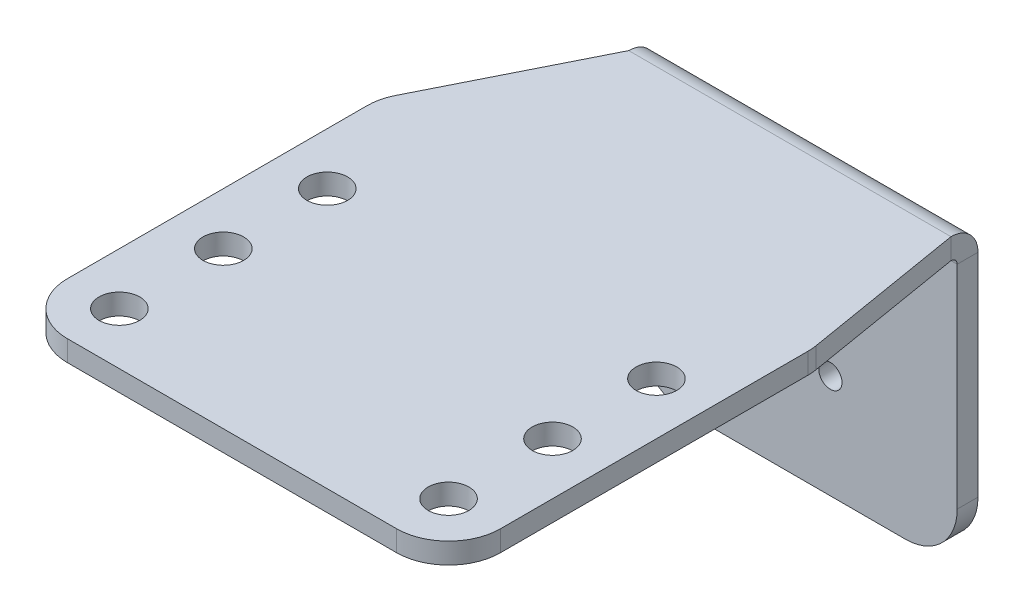
ISO-10303-21;
HEADER;
FILE_DESCRIPTION(('STEP AP214'),'2;1');
FILE_NAME('part.step','',(''),(''),'','','');
FILE_SCHEMA(('AUTOMOTIVE_DESIGN { 1 0 10303 214 1 1 1 1 }'));
ENDSEC;
DATA;
#1=APPLICATION_CONTEXT('core data for automotive mechanical design processes');
#2=APPLICATION_PROTOCOL_DEFINITION('international standard','automotive_design',2000,#1);
#3=PRODUCT_CONTEXT('',#1,'mechanical');
#4=PRODUCT('Part','Part','',(#3));
#5=PRODUCT_RELATED_PRODUCT_CATEGORY('part','',(#4));
#6=PRODUCT_DEFINITION_FORMATION('','',#4);
#7=PRODUCT_DEFINITION_CONTEXT('part definition',#1,'design');
#8=PRODUCT_DEFINITION('design','',#6,#7);
#9=PRODUCT_DEFINITION_SHAPE('','',#8);
#10=(LENGTH_UNIT() NAMED_UNIT(*) SI_UNIT(.MILLI.,.METRE.));
#11=(NAMED_UNIT(*) PLANE_ANGLE_UNIT() SI_UNIT($,.RADIAN.));
#12=(NAMED_UNIT(*) SI_UNIT($,.STERADIAN.) SOLID_ANGLE_UNIT());
#13=UNCERTAINTY_MEASURE_WITH_UNIT(LENGTH_MEASURE(1.E-05),#10,'distance_accuracy_value','');
#14=(GEOMETRIC_REPRESENTATION_CONTEXT(3) GLOBAL_UNCERTAINTY_ASSIGNED_CONTEXT((#13)) GLOBAL_UNIT_ASSIGNED_CONTEXT((#10,
#11,#12)) REPRESENTATION_CONTEXT('',''));
#15=CARTESIAN_POINT('',(0.,0.,0.));
#16=DIRECTION('',(0.,0.,1.));
#17=DIRECTION('',(1.,0.,0.));
#18=AXIS2_PLACEMENT_3D('',#15,#16,#17);
#19=CARTESIAN_POINT('',(0.,2.54,0.));
#20=DIRECTION('',(1.,0.,0.));
#21=DIRECTION('',(0.,0.,-1.));
#22=AXIS2_PLACEMENT_3D('',#19,#20,#21);
#23=PLANE('',#22);
#24=DIRECTION('',(0.,0.,1.));
#25=VECTOR('',#24,1.);
#26=CARTESIAN_POINT('',(0.,2.54,0.));
#27=LINE('',#26,#25);
#28=CARTESIAN_POINT('',(0.,2.54,-42.9509683428763));
#29=VERTEX_POINT('',#28);
#30=CARTESIAN_POINT('',(0.,2.54,-6.35));
#31=VERTEX_POINT('',#30);
#32=EDGE_CURVE('E221',#29,#31,#27,.T.);
#33=ORIENTED_EDGE('',*,*,#32,.F.);
#34=DIRECTION('',(0.,-1.,0.));
#35=VECTOR('',#34,1.);
#36=CARTESIAN_POINT('',(0.,2.54,-42.9509683428763));
#37=LINE('',#36,#35);
#38=CARTESIAN_POINT('',(0.,0.,-42.9509683428763));
#39=VERTEX_POINT('',#38);
#40=EDGE_CURVE('E308',#29,#39,#37,.T.);
#41=ORIENTED_EDGE('',*,*,#40,.T.);
#42=DIRECTION('',(0.,0.,1.));
#43=VECTOR('',#42,1.);
#44=CARTESIAN_POINT('',(0.,0.,0.));
#45=LINE('',#44,#43);
#46=CARTESIAN_POINT('',(0.,0.,-6.35));
#47=VERTEX_POINT('',#46);
#48=EDGE_CURVE('E216',#39,#47,#45,.T.);
#49=ORIENTED_EDGE('',*,*,#48,.T.);
#50=DIRECTION('',(0.,-1.,0.));
#51=VECTOR('',#50,1.);
#52=CARTESIAN_POINT('',(0.,2.54,-6.35));
#53=LINE('',#52,#51);
#54=EDGE_CURVE('E306',#47,#31,#53,.F.);
#55=ORIENTED_EDGE('',*,*,#54,.T.);
#56=EDGE_LOOP('',(#33,#41,#49,#55));
#57=FACE_BOUND('',#56,.T.);
#58=ADVANCED_FACE('F57',(#57),#23,.F.);
#59=CARTESIAN_POINT('',(0.,2.54,0.));
#60=DIRECTION('',(0.,0.,-1.));
#61=DIRECTION('',(-1.,0.,0.));
#62=AXIS2_PLACEMENT_3D('',#59,#60,#61);
#63=PLANE('',#62);
#64=DIRECTION('',(1.,0.,0.));
#65=VECTOR('',#64,1.);
#66=CARTESIAN_POINT('',(0.,0.,0.));
#67=LINE('',#66,#65);
#68=CARTESIAN_POINT('',(6.35,0.,0.));
#69=VERTEX_POINT('',#68);
#70=CARTESIAN_POINT('',(46.5666666666667,0.,0.));
#71=VERTEX_POINT('',#70);
#72=EDGE_CURVE('E240',#69,#71,#67,.T.);
#73=ORIENTED_EDGE('',*,*,#72,.T.);
#74=DIRECTION('',(0.,-1.,0.));
#75=VECTOR('',#74,1.);
#76=CARTESIAN_POINT('',(46.5666666666667,2.54,0.));
#77=LINE('',#76,#75);
#78=CARTESIAN_POINT('',(46.5666666666667,2.54,0.));
#79=VERTEX_POINT('',#78);
#80=EDGE_CURVE('E316',#71,#79,#77,.F.);
#81=ORIENTED_EDGE('',*,*,#80,.T.);
#82=DIRECTION('',(1.,0.,0.));
#83=VECTOR('',#82,1.);
#84=CARTESIAN_POINT('',(0.,2.54,0.));
#85=LINE('',#84,#83);
#86=CARTESIAN_POINT('',(6.35,2.54,0.));
#87=VERTEX_POINT('',#86);
#88=EDGE_CURVE('E224',#87,#79,#85,.T.);
#89=ORIENTED_EDGE('',*,*,#88,.F.);
#90=DIRECTION('',(0.,-1.,0.));
#91=VECTOR('',#90,1.);
#92=CARTESIAN_POINT('',(6.35,2.54,0.));
#93=LINE('',#92,#91);
#94=EDGE_CURVE('E313',#87,#69,#93,.T.);
#95=ORIENTED_EDGE('',*,*,#94,.T.);
#96=EDGE_LOOP('',(#73,#81,#89,#95));
#97=FACE_BOUND('',#96,.T.);
#98=ADVANCED_FACE('F393',(#97),#63,.F.);
#99=CARTESIAN_POINT('',(52.9166666666667,2.54,0.));
#100=DIRECTION('',(-1.,0.,0.));
#101=DIRECTION('',(0.,0.,1.));
#102=AXIS2_PLACEMENT_3D('',#99,#100,#101);
#103=PLANE('',#102);
#104=DIRECTION('',(0.,0.,-1.));
#105=VECTOR('',#104,1.);
#106=CARTESIAN_POINT('',(52.9166666666667,0.,0.));
#107=LINE('',#106,#105);
#108=CARTESIAN_POINT('',(52.9166666666667,0.,-6.35));
#109=VERTEX_POINT('',#108);
#110=CARTESIAN_POINT('',(52.9166666666667,0.,-43.9244579326063));
#111=VERTEX_POINT('',#110);
#112=EDGE_CURVE('E243',#109,#111,#107,.T.);
#113=ORIENTED_EDGE('',*,*,#112,.T.);
#114=DIRECTION('',(0.,-1.,0.));
#115=VECTOR('',#114,1.);
#116=CARTESIAN_POINT('',(52.9166666666667,2.54,-43.9244579326063));
#117=LINE('',#116,#115);
#118=CARTESIAN_POINT('',(52.9166666666667,2.54,-43.9244579326063));
#119=VERTEX_POINT('',#118);
#120=EDGE_CURVE('E296',#111,#119,#117,.F.);
#121=ORIENTED_EDGE('',*,*,#120,.T.);
#122=DIRECTION('',(0.,0.,-1.));
#123=VECTOR('',#122,1.);
#124=CARTESIAN_POINT('',(52.9166666666667,2.54,0.));
#125=LINE('',#124,#123);
#126=CARTESIAN_POINT('',(52.9166666666667,2.54,-6.35));
#127=VERTEX_POINT('',#126);
#128=EDGE_CURVE('E228',#127,#119,#125,.T.);
#129=ORIENTED_EDGE('',*,*,#128,.F.);
#130=DIRECTION('',(0.,-1.,0.));
#131=VECTOR('',#130,1.);
#132=CARTESIAN_POINT('',(52.9166666666667,2.54,-6.35));
#133=LINE('',#132,#131);
#134=EDGE_CURVE('E293',#127,#109,#133,.T.);
#135=ORIENTED_EDGE('',*,*,#134,.T.);
#136=EDGE_LOOP('',(#113,#121,#129,#135));
#137=FACE_BOUND('',#136,.T.);
#138=ADVANCED_FACE('F399',(#137),#103,.F.);
#139=CARTESIAN_POINT('',(49.53,2.54,-64.77));
#140=DIRECTION('',(-0.986393923832144,0.,0.164398987305357));
#141=DIRECTION('',(0.164398987305357,0.,0.986393923832144));
#142=AXIS2_PLACEMENT_3D('',#139,#140,#141);
#143=PLANE('',#142);
#144=DIRECTION('',(-0.164398987305357,0.,-0.986393923832144));
#145=VECTOR('',#144,1.);
#146=CARTESIAN_POINT('',(49.53,2.54,-64.77));
#147=LINE('',#146,#145);
#148=CARTESIAN_POINT('',(52.8302680830008,2.54,-44.9683915019953));
#149=VERTEX_POINT('',#148);
#150=CARTESIAN_POINT('',(49.53,2.54,-64.77));
#151=VERTEX_POINT('',#150);
#152=EDGE_CURVE('E231',#149,#151,#147,.T.);
#153=ORIENTED_EDGE('',*,*,#152,.F.);
#154=DIRECTION('',(0.,-1.,0.));
#155=VECTOR('',#154,1.);
#156=CARTESIAN_POINT('',(52.8302680830008,2.54,-44.9683915019953));
#157=LINE('',#156,#155);
#158=CARTESIAN_POINT('',(52.8302680830008,0.,-44.9683915019953));
#159=VERTEX_POINT('',#158);
#160=EDGE_CURVE('E256',#149,#159,#157,.T.);
#161=ORIENTED_EDGE('',*,*,#160,.T.);
#162=DIRECTION('',(-0.164398987305357,0.,-0.986393923832144));
#163=VECTOR('',#162,1.);
#164=CARTESIAN_POINT('',(49.53,0.,-64.77));
#165=LINE('',#164,#163);
#166=CARTESIAN_POINT('',(49.53,0.,-64.77));
#167=VERTEX_POINT('',#166);
#168=EDGE_CURVE('E246',#159,#167,#165,.T.);
#169=ORIENTED_EDGE('',*,*,#168,.T.);
#170=DIRECTION('',(0.,-1.,0.));
#171=VECTOR('',#170,1.);
#172=CARTESIAN_POINT('',(49.53,2.54,-64.77));
#173=LINE('',#172,#171);
#174=EDGE_CURVE('E254',#151,#167,#173,.T.);
#175=ORIENTED_EDGE('',*,*,#174,.F.);
#176=EDGE_LOOP('',(#153,#161,#169,#175));
#177=FACE_BOUND('',#176,.T.);
#178=ADVANCED_FACE('F466',(#177),#143,.F.);
#179=CARTESIAN_POINT('',(0.,2.54,-44.45));
#180=DIRECTION('',(0.894427190999916,0.,0.447213595499958));
#181=DIRECTION('',(0.447213595499958,0.,-0.894427190999916));
#182=AXIS2_PLACEMENT_3D('',#179,#180,#181);
#183=PLANE('',#182);
#184=DIRECTION('',(-0.447213595499958,0.,0.894427190999916));
#185=VECTOR('',#184,1.);
#186=CARTESIAN_POINT('',(0.,0.,-44.45));
#187=LINE('',#186,#185);
#188=CARTESIAN_POINT('',(10.16,0.,-64.77));
#189=VERTEX_POINT('',#188);
#190=CARTESIAN_POINT('',(0.670387337150534,0.,-45.7907746743011));
#191=VERTEX_POINT('',#190);
#192=EDGE_CURVE('E225',#189,#191,#187,.T.);
#193=ORIENTED_EDGE('',*,*,#192,.T.);
#194=DIRECTION('',(0.,-1.,0.));
#195=VECTOR('',#194,1.);
#196=CARTESIAN_POINT('',(0.670387337150535,2.54,-45.7907746743011));
#197=LINE('',#196,#195);
#198=CARTESIAN_POINT('',(0.670387337150534,2.54,-45.7907746743011));
#199=VERTEX_POINT('',#198);
#200=EDGE_CURVE('E311',#191,#199,#197,.F.);
#201=ORIENTED_EDGE('',*,*,#200,.T.);
#202=DIRECTION('',(-0.447213595499958,0.,0.894427190999916));
#203=VECTOR('',#202,1.);
#204=CARTESIAN_POINT('',(0.,2.54,-44.45));
#205=LINE('',#204,#203);
#206=CARTESIAN_POINT('',(10.16,2.54,-64.77));
#207=VERTEX_POINT('',#206);
#208=EDGE_CURVE('E234',#207,#199,#205,.T.);
#209=ORIENTED_EDGE('',*,*,#208,.F.);
#210=DIRECTION('',(0.,-1.,0.));
#211=VECTOR('',#210,1.);
#212=CARTESIAN_POINT('',(10.16,2.54,-64.77));
#213=LINE('',#212,#211);
#214=EDGE_CURVE('E237',#207,#189,#213,.T.);
#215=ORIENTED_EDGE('',*,*,#214,.T.);
#216=EDGE_LOOP('',(#193,#201,#209,#215));
#217=FACE_BOUND('',#216,.T.);
#218=ADVANCED_FACE('F440',(#217),#183,.F.);
#219=CARTESIAN_POINT('',(0.,2.54,0.));
#220=DIRECTION('',(0.,-1.,0.));
#221=DIRECTION('',(0.,0.,-1.));
#222=AXIS2_PLACEMENT_3D('',#219,#220,#221);
#223=PLANE('',#222);
#224=CARTESIAN_POINT('',(6.35,2.54,-31.75));
#225=DIRECTION('',(0.,1.,0.));
#226=DIRECTION('',(0.,0.,1.));
#227=AXIS2_PLACEMENT_3D('',#224,#225,#226);
#228=CIRCLE('',#227,2.4892);
#229=CARTESIAN_POINT('',(6.35,2.54,-29.2608));
#230=VERTEX_POINT('',#229);
#231=EDGE_CURVE('E282',#230,#230,#228,.T.);
#232=ORIENTED_EDGE('',*,*,#231,.F.);
#233=EDGE_LOOP('',(#232));
#234=FACE_BOUND('',#233,.T.);
#235=CARTESIAN_POINT('',(6.35,2.54,-19.05));
#236=DIRECTION('',(0.,1.,0.));
#237=DIRECTION('',(0.,0.,1.));
#238=AXIS2_PLACEMENT_3D('',#235,#236,#237);
#239=CIRCLE('',#238,2.4892);
#240=CARTESIAN_POINT('',(6.35,2.54,-16.5608));
#241=VERTEX_POINT('',#240);
#242=EDGE_CURVE('E350',#241,#241,#239,.T.);
#243=ORIENTED_EDGE('',*,*,#242,.F.);
#244=EDGE_LOOP('',(#243));
#245=FACE_BOUND('',#244,.T.);
#246=CARTESIAN_POINT('',(6.35,2.54,-6.35));
#247=DIRECTION('',(0.,1.,0.));
#248=DIRECTION('',(0.,0.,1.));
#249=AXIS2_PLACEMENT_3D('',#246,#247,#248);
#250=CIRCLE('',#249,2.4892);
#251=CARTESIAN_POINT('',(6.35,2.54,-3.8608));
#252=VERTEX_POINT('',#251);
#253=EDGE_CURVE('E353',#252,#252,#250,.T.);
#254=ORIENTED_EDGE('',*,*,#253,.F.);
#255=EDGE_LOOP('',(#254));
#256=FACE_BOUND('',#255,.T.);
#257=CARTESIAN_POINT('',(46.5666666666667,2.54,-6.35));
#258=DIRECTION('',(0.,1.,0.));
#259=DIRECTION('',(0.,0.,1.));
#260=AXIS2_PLACEMENT_3D('',#257,#258,#259);
#261=CIRCLE('',#260,2.4892);
#262=CARTESIAN_POINT('',(46.5666666666667,2.54,-3.8608));
#263=VERTEX_POINT('',#262);
#264=EDGE_CURVE('E356',#263,#263,#261,.T.);
#265=ORIENTED_EDGE('',*,*,#264,.F.);
#266=EDGE_LOOP('',(#265));
#267=FACE_BOUND('',#266,.T.);
#268=CARTESIAN_POINT('',(46.5666666666667,2.54,-19.05));
#269=DIRECTION('',(0.,1.,0.));
#270=DIRECTION('',(0.,0.,1.));
#271=AXIS2_PLACEMENT_3D('',#268,#269,#270);
#272=CIRCLE('',#271,2.4892);
#273=CARTESIAN_POINT('',(46.5666666666667,2.54,-16.5608));
#274=VERTEX_POINT('',#273);
#275=EDGE_CURVE('E347',#274,#274,#272,.T.);
#276=ORIENTED_EDGE('',*,*,#275,.F.);
#277=EDGE_LOOP('',(#276));
#278=FACE_BOUND('',#277,.T.);
#279=CARTESIAN_POINT('',(46.5666666666667,2.54,-31.75));
#280=DIRECTION('',(0.,1.,0.));
#281=DIRECTION('',(0.,0.,1.));
#282=AXIS2_PLACEMENT_3D('',#279,#280,#281);
#283=CIRCLE('',#282,2.4892);
#284=CARTESIAN_POINT('',(46.5666666666667,2.54,-29.2608));
#285=VERTEX_POINT('',#284);
#286=EDGE_CURVE('E261',#285,#285,#283,.T.);
#287=ORIENTED_EDGE('',*,*,#286,.F.);
#288=EDGE_LOOP('',(#287));
#289=FACE_BOUND('',#288,.T.);
#290=ORIENTED_EDGE('',*,*,#128,.T.);
#291=CARTESIAN_POINT('',(46.5666666666667,2.54,-43.9244579326063));
#292=DIRECTION('',(0.,-1.,0.));
#293=DIRECTION('',(0.,0.,-1.));
#294=AXIS2_PLACEMENT_3D('',#291,#292,#293);
#295=CIRCLE('',#294,6.35);
#296=EDGE_CURVE('E304',#119,#149,#295,.F.);
#297=ORIENTED_EDGE('',*,*,#296,.T.);
#298=ORIENTED_EDGE('',*,*,#152,.T.);
#299=DIRECTION('',(-1.,0.,0.));
#300=VECTOR('',#299,1.);
#301=CARTESIAN_POINT('',(10.16,2.54,-64.77));
#302=LINE('',#301,#300);
#303=EDGE_CURVE('E189',#151,#207,#302,.T.);
#304=ORIENTED_EDGE('',*,*,#303,.T.);
#305=ORIENTED_EDGE('',*,*,#208,.T.);
#306=CARTESIAN_POINT('',(6.35,2.54,-42.9509683428763));
#307=DIRECTION('',(0.,-1.,0.));
#308=DIRECTION('',(0.,0.,-1.));
#309=AXIS2_PLACEMENT_3D('',#306,#307,#308);
#310=CIRCLE('',#309,6.35);
#311=EDGE_CURVE('E302',#199,#29,#310,.F.);
#312=ORIENTED_EDGE('',*,*,#311,.T.);
#313=ORIENTED_EDGE('',*,*,#32,.T.);
#314=CARTESIAN_POINT('',(6.35,2.54,-6.35));
#315=DIRECTION('',(0.,-1.,0.));
#316=DIRECTION('',(0.,0.,-1.));
#317=AXIS2_PLACEMENT_3D('',#314,#315,#316);
#318=CIRCLE('',#317,6.35);
#319=EDGE_CURVE('E298',#31,#87,#318,.F.);
#320=ORIENTED_EDGE('',*,*,#319,.T.);
#321=ORIENTED_EDGE('',*,*,#88,.T.);
#322=CARTESIAN_POINT('',(46.5666666666667,2.54,-6.35));
#323=DIRECTION('',(0.,-1.,0.));
#324=DIRECTION('',(0.,0.,-1.));
#325=AXIS2_PLACEMENT_3D('',#322,#323,#324);
#326=CIRCLE('',#325,6.35);
#327=EDGE_CURVE('E300',#79,#127,#326,.F.);
#328=ORIENTED_EDGE('',*,*,#327,.T.);
#329=EDGE_LOOP('',(#290,#297,#298,#304,#305,#312,#313,#320,#321,#328));
#330=FACE_BOUND('',#329,.T.);
#331=ADVANCED_FACE('F451',(#234,#245,#256,#267,#278,#289,#330),#223,.F.);
#332=CARTESIAN_POINT('',(0.,0.,0.));
#333=DIRECTION('',(0.,-1.,0.));
#334=DIRECTION('',(0.,0.,-1.));
#335=AXIS2_PLACEMENT_3D('',#332,#333,#334);
#336=PLANE('',#335);
#337=CARTESIAN_POINT('',(6.35,0.,-31.75));
#338=DIRECTION('',(0.,-1.,0.));
#339=DIRECTION('',(0.,0.,-1.));
#340=AXIS2_PLACEMENT_3D('',#337,#338,#339);
#341=CIRCLE('',#340,2.4892);
#342=CARTESIAN_POINT('',(6.35,0.,-34.2392));
#343=VERTEX_POINT('',#342);
#344=EDGE_CURVE('E215',#343,#343,#341,.T.);
#345=ORIENTED_EDGE('',*,*,#344,.F.);
#346=EDGE_LOOP('',(#345));
#347=FACE_BOUND('',#346,.T.);
#348=CARTESIAN_POINT('',(6.35,0.,-19.05));
#349=DIRECTION('',(0.,-1.,0.));
#350=DIRECTION('',(0.,0.,-1.));
#351=AXIS2_PLACEMENT_3D('',#348,#349,#350);
#352=CIRCLE('',#351,2.4892);
#353=CARTESIAN_POINT('',(6.35,0.,-21.5392));
#354=VERTEX_POINT('',#353);
#355=EDGE_CURVE('E270',#354,#354,#352,.T.);
#356=ORIENTED_EDGE('',*,*,#355,.F.);
#357=EDGE_LOOP('',(#356));
#358=FACE_BOUND('',#357,.T.);
#359=CARTESIAN_POINT('',(6.35,0.,-6.35));
#360=DIRECTION('',(0.,-1.,0.));
#361=DIRECTION('',(0.,0.,-1.));
#362=AXIS2_PLACEMENT_3D('',#359,#360,#361);
#363=CIRCLE('',#362,2.4892);
#364=CARTESIAN_POINT('',(6.35,0.,-8.8392));
#365=VERTEX_POINT('',#364);
#366=EDGE_CURVE('E267',#365,#365,#363,.T.);
#367=ORIENTED_EDGE('',*,*,#366,.F.);
#368=EDGE_LOOP('',(#367));
#369=FACE_BOUND('',#368,.T.);
#370=CARTESIAN_POINT('',(46.5666666666667,0.,-6.35));
#371=DIRECTION('',(0.,-1.,0.));
#372=DIRECTION('',(0.,0.,-1.));
#373=AXIS2_PLACEMENT_3D('',#370,#371,#372);
#374=CIRCLE('',#373,2.4892);
#375=CARTESIAN_POINT('',(46.5666666666667,0.,-8.83919999999999));
#376=VERTEX_POINT('',#375);
#377=EDGE_CURVE('E264',#376,#376,#374,.T.);
#378=ORIENTED_EDGE('',*,*,#377,.F.);
#379=EDGE_LOOP('',(#378));
#380=FACE_BOUND('',#379,.T.);
#381=CARTESIAN_POINT('',(46.5666666666667,0.,-19.05));
#382=DIRECTION('',(0.,-1.,0.));
#383=DIRECTION('',(0.,0.,-1.));
#384=AXIS2_PLACEMENT_3D('',#381,#382,#383);
#385=CIRCLE('',#384,2.4892);
#386=CARTESIAN_POINT('',(46.5666666666667,0.,-21.5392));
#387=VERTEX_POINT('',#386);
#388=EDGE_CURVE('E260',#387,#387,#385,.T.);
#389=ORIENTED_EDGE('',*,*,#388,.F.);
#390=EDGE_LOOP('',(#389));
#391=FACE_BOUND('',#390,.T.);
#392=CARTESIAN_POINT('',(46.5666666666667,0.,-31.75));
#393=DIRECTION('',(0.,-1.,0.));
#394=DIRECTION('',(0.,0.,-1.));
#395=AXIS2_PLACEMENT_3D('',#392,#393,#394);
#396=CIRCLE('',#395,2.4892);
#397=CARTESIAN_POINT('',(46.5666666666667,0.,-34.2392));
#398=VERTEX_POINT('',#397);
#399=EDGE_CURVE('E257',#398,#398,#396,.T.);
#400=ORIENTED_EDGE('',*,*,#399,.F.);
#401=EDGE_LOOP('',(#400));
#402=FACE_BOUND('',#401,.T.);
#403=ORIENTED_EDGE('',*,*,#168,.F.);
#404=CARTESIAN_POINT('',(46.5666666666667,0.,-43.9244579326063));
#405=DIRECTION('',(0.,-1.,0.));
#406=DIRECTION('',(0.,0.,-1.));
#407=AXIS2_PLACEMENT_3D('',#404,#405,#406);
#408=CIRCLE('',#407,6.35);
#409=EDGE_CURVE('E291',#159,#111,#408,.T.);
#410=ORIENTED_EDGE('',*,*,#409,.T.);
#411=ORIENTED_EDGE('',*,*,#112,.F.);
#412=CARTESIAN_POINT('',(46.5666666666667,0.,-6.35));
#413=DIRECTION('',(0.,-1.,0.));
#414=DIRECTION('',(0.,0.,-1.));
#415=AXIS2_PLACEMENT_3D('',#412,#413,#414);
#416=CIRCLE('',#415,6.35);
#417=EDGE_CURVE('E287',#109,#71,#416,.T.);
#418=ORIENTED_EDGE('',*,*,#417,.T.);
#419=ORIENTED_EDGE('',*,*,#72,.F.);
#420=CARTESIAN_POINT('',(6.35,0.,-6.35));
#421=DIRECTION('',(0.,-1.,0.));
#422=DIRECTION('',(0.,0.,-1.));
#423=AXIS2_PLACEMENT_3D('',#420,#421,#422);
#424=CIRCLE('',#423,6.35);
#425=EDGE_CURVE('E285',#69,#47,#424,.T.);
#426=ORIENTED_EDGE('',*,*,#425,.T.);
#427=ORIENTED_EDGE('',*,*,#48,.F.);
#428=CARTESIAN_POINT('',(6.35,0.,-42.9509683428763));
#429=DIRECTION('',(0.,-1.,0.));
#430=DIRECTION('',(0.,0.,-1.));
#431=AXIS2_PLACEMENT_3D('',#428,#429,#430);
#432=CIRCLE('',#431,6.35);
#433=EDGE_CURVE('E289',#39,#191,#432,.T.);
#434=ORIENTED_EDGE('',*,*,#433,.T.);
#435=ORIENTED_EDGE('',*,*,#192,.F.);
#436=DIRECTION('',(-1.,0.,0.));
#437=VECTOR('',#436,1.);
#438=CARTESIAN_POINT('',(10.16,0.,-64.77));
#439=LINE('',#438,#437);
#440=EDGE_CURVE('E248',#167,#189,#439,.T.);
#441=ORIENTED_EDGE('',*,*,#440,.F.);
#442=EDGE_LOOP('',(#403,#410,#411,#418,#419,#426,#427,#434,#435,#441));
#443=FACE_BOUND('',#442,.T.);
#444=ADVANCED_FACE('F444',(#347,#358,#369,#380,#391,#402,#443),#336,.T.);
#445=CARTESIAN_POINT('',(10.16,-0.762000000000004,-64.77));
#446=DIRECTION('',(-1.,0.,0.));
#447=DIRECTION('',(0.,0.,1.));
#448=AXIS2_PLACEMENT_3D('',#445,#446,#447);
#449=PLANE('',#448);
#450=DIRECTION('',(0.,0.,-1.));
#451=VECTOR('',#450,1.);
#452=CARTESIAN_POINT('',(10.16,-0.761999999999978,-68.0719999999999));
#453=LINE('',#452,#451);
#454=CARTESIAN_POINT('',(10.16,-0.762000000000001,-65.532));
#455=VERTEX_POINT('',#454);
#456=CARTESIAN_POINT('',(10.16,-0.761999999999993,-68.072));
#457=VERTEX_POINT('',#456);
#458=EDGE_CURVE('E212',#455,#457,#453,.T.);
#459=ORIENTED_EDGE('',*,*,#458,.F.);
#460=CARTESIAN_POINT('',(10.16,-0.762000000000004,-64.77));
#461=DIRECTION('',(1.,0.,0.));
#462=DIRECTION('',(0.,0.,-1.));
#463=AXIS2_PLACEMENT_3D('',#460,#461,#462);
#464=CIRCLE('',#463,0.761999999999999);
#465=EDGE_CURVE('E194',#189,#455,#464,.F.);
#466=ORIENTED_EDGE('',*,*,#465,.F.);
#467=ORIENTED_EDGE('',*,*,#214,.F.);
#468=CARTESIAN_POINT('',(10.16,-0.762000000000004,-64.77));
#469=DIRECTION('',(1.,0.,0.));
#470=DIRECTION('',(0.,0.,-1.));
#471=AXIS2_PLACEMENT_3D('',#468,#469,#470);
#472=CIRCLE('',#471,3.302);
#473=EDGE_CURVE('E193',#207,#457,#472,.F.);
#474=ORIENTED_EDGE('',*,*,#473,.T.);
#475=EDGE_LOOP('',(#459,#466,#467,#474));
#476=FACE_BOUND('',#475,.T.);
#477=ADVANCED_FACE('F436',(#476),#449,.T.);
#478=CARTESIAN_POINT('',(49.53,-0.762000000000004,-64.77));
#479=DIRECTION('',(-1.,0.,0.));
#480=DIRECTION('',(0.,0.,1.));
#481=AXIS2_PLACEMENT_3D('',#478,#479,#480);
#482=PLANE('',#481);
#483=CARTESIAN_POINT('',(49.53,-0.762000000000004,-64.77));
#484=DIRECTION('',(1.,0.,0.));
#485=DIRECTION('',(0.,0.,-1.));
#486=AXIS2_PLACEMENT_3D('',#483,#484,#485);
#487=CIRCLE('',#486,0.761999999999999);
#488=CARTESIAN_POINT('',(49.53,-0.762000000000001,-65.532));
#489=VERTEX_POINT('',#488);
#490=EDGE_CURVE('E178',#489,#167,#487,.T.);
#491=ORIENTED_EDGE('',*,*,#490,.F.);
#492=DIRECTION('',(0.,0.,-1.));
#493=VECTOR('',#492,1.);
#494=CARTESIAN_POINT('',(49.53,-0.761999999999999,-65.532));
#495=LINE('',#494,#493);
#496=CARTESIAN_POINT('',(49.53,-0.761999999999981,-68.072));
#497=VERTEX_POINT('',#496);
#498=EDGE_CURVE('E175',#489,#497,#495,.T.);
#499=ORIENTED_EDGE('',*,*,#498,.T.);
#500=CARTESIAN_POINT('',(49.53,-0.762000000000004,-64.77));
#501=DIRECTION('',(1.,0.,0.));
#502=DIRECTION('',(0.,0.,-1.));
#503=AXIS2_PLACEMENT_3D('',#500,#501,#502);
#504=CIRCLE('',#503,3.302);
#505=EDGE_CURVE('E184',#497,#151,#504,.T.);
#506=ORIENTED_EDGE('',*,*,#505,.T.);
#507=ORIENTED_EDGE('',*,*,#174,.T.);
#508=EDGE_LOOP('',(#491,#499,#506,#507));
#509=FACE_BOUND('',#508,.T.);
#510=ADVANCED_FACE('F197',(#509),#482,.F.);
#511=CARTESIAN_POINT('',(49.53,-0.762000000000004,-64.77));
#512=DIRECTION('',(1.,0.,0.));
#513=DIRECTION('',(0.,0.,-1.));
#514=AXIS2_PLACEMENT_3D('',#511,#512,#513);
#515=CYLINDRICAL_SURFACE('',#514,3.302);
#516=ORIENTED_EDGE('',*,*,#303,.F.);
#517=ORIENTED_EDGE('',*,*,#505,.F.);
#518=DIRECTION('',(1.,0.,0.));
#519=VECTOR('',#518,1.);
#520=CARTESIAN_POINT('',(0.,-0.761999999999981,-68.072));
#521=LINE('',#520,#519);
#522=EDGE_CURVE('E186',#457,#497,#521,.T.);
#523=ORIENTED_EDGE('',*,*,#522,.F.);
#524=ORIENTED_EDGE('',*,*,#473,.F.);
#525=EDGE_LOOP('',(#516,#517,#523,#524));
#526=FACE_BOUND('',#525,.T.);
#527=ADVANCED_FACE('F185',(#526),#515,.T.);
#528=CARTESIAN_POINT('',(49.53,-0.762000000000004,-64.77));
#529=DIRECTION('',(1.,0.,0.));
#530=DIRECTION('',(0.,0.,-1.));
#531=AXIS2_PLACEMENT_3D('',#528,#529,#530);
#532=CYLINDRICAL_SURFACE('',#531,0.761999999999999);
#533=ORIENTED_EDGE('',*,*,#440,.T.);
#534=ORIENTED_EDGE('',*,*,#465,.T.);
#535=DIRECTION('',(-1.,0.,0.));
#536=VECTOR('',#535,1.);
#537=CARTESIAN_POINT('',(10.16,-0.761999999999999,-65.532));
#538=LINE('',#537,#536);
#539=EDGE_CURVE('E199',#455,#489,#538,.F.);
#540=ORIENTED_EDGE('',*,*,#539,.T.);
#541=ORIENTED_EDGE('',*,*,#490,.T.);
#542=EDGE_LOOP('',(#533,#534,#540,#541));
#543=FACE_BOUND('',#542,.T.);
#544=ADVANCED_FACE('F431',(#543),#532,.F.);
#545=CARTESIAN_POINT('',(49.53,0.,-68.072));
#546=DIRECTION('',(1.,0.,0.));
#547=DIRECTION('',(0.,0.,-1.));
#548=AXIS2_PLACEMENT_3D('',#545,#546,#547);
#549=PLANE('',#548);
#550=DIRECTION('',(0.,-1.,0.));
#551=VECTOR('',#550,1.);
#552=CARTESIAN_POINT('',(49.53,2.17774516368781E-13,-65.532));
#553=LINE('',#552,#551);
#554=CARTESIAN_POINT('',(49.53,-26.67,-65.5320000000001));
#555=VERTEX_POINT('',#554);
#556=EDGE_CURVE('E341',#555,#489,#553,.F.);
#557=ORIENTED_EDGE('',*,*,#556,.F.);
#558=DIRECTION('',(0.,0.,1.));
#559=VECTOR('',#558,1.);
#560=CARTESIAN_POINT('',(49.53,-26.67,-68.0720000000001));
#561=LINE('',#560,#559);
#562=CARTESIAN_POINT('',(49.53,-26.67,-68.0720000000001));
#563=VERTEX_POINT('',#562);
#564=EDGE_CURVE('E80',#555,#563,#561,.F.);
#565=ORIENTED_EDGE('',*,*,#564,.T.);
#566=DIRECTION('',(0.,1.,0.));
#567=VECTOR('',#566,1.);
#568=CARTESIAN_POINT('',(49.53,0.,-68.072));
#569=LINE('',#568,#567);
#570=EDGE_CURVE('E171',#563,#497,#569,.T.);
#571=ORIENTED_EDGE('',*,*,#570,.T.);
#572=ORIENTED_EDGE('',*,*,#498,.F.);
#573=EDGE_LOOP('',(#557,#565,#571,#572));
#574=FACE_BOUND('',#573,.T.);
#575=ADVANCED_FACE('F173',(#574),#549,.T.);
#576=CARTESIAN_POINT('',(10.16,-33.02,-68.0720000000001));
#577=DIRECTION('',(-1.,0.,0.));
#578=DIRECTION('',(0.,-1.,0.));
#579=AXIS2_PLACEMENT_3D('',#576,#577,#578);
#580=PLANE('',#579);
#581=DIRECTION('',(0.,-1.,0.));
#582=VECTOR('',#581,1.);
#583=CARTESIAN_POINT('',(10.16,-33.02,-68.0720000000001));
#584=LINE('',#583,#582);
#585=CARTESIAN_POINT('',(10.16,-26.67,-68.0720000000001));
#586=VERTEX_POINT('',#585);
#587=EDGE_CURVE('E202',#457,#586,#584,.T.);
#588=ORIENTED_EDGE('',*,*,#587,.T.);
#589=DIRECTION('',(0.,0.,1.));
#590=VECTOR('',#589,1.);
#591=CARTESIAN_POINT('',(10.16,-26.67,-68.0720000000001));
#592=LINE('',#591,#590);
#593=CARTESIAN_POINT('',(10.16,-26.67,-65.5320000000001));
#594=VERTEX_POINT('',#593);
#595=EDGE_CURVE('E13',#586,#594,#592,.T.);
#596=ORIENTED_EDGE('',*,*,#595,.T.);
#597=DIRECTION('',(0.,1.,0.));
#598=VECTOR('',#597,1.);
#599=CARTESIAN_POINT('',(10.16,2.18308277438312E-13,-65.532));
#600=LINE('',#599,#598);
#601=EDGE_CURVE('E203',#455,#594,#600,.F.);
#602=ORIENTED_EDGE('',*,*,#601,.F.);
#603=ORIENTED_EDGE('',*,*,#458,.T.);
#604=EDGE_LOOP('',(#588,#596,#602,#603));
#605=FACE_BOUND('',#604,.T.);
#606=ADVANCED_FACE('F372',(#605),#580,.T.);
#607=CARTESIAN_POINT('',(0.,2.26642878969442E-13,-68.072));
#608=DIRECTION('',(0.,0.,-1.));
#609=DIRECTION('',(0.,1.,0.));
#610=AXIS2_PLACEMENT_3D('',#607,#608,#609);
#611=PLANE('',#610);
#612=CARTESIAN_POINT('',(34.035000002,-20.32,-68.0719999999999));
#613=DIRECTION('',(0.,0.,-1.));
#614=DIRECTION('',(0.,1.,0.));
#615=AXIS2_PLACEMENT_3D('',#612,#613,#614);
#616=CIRCLE('',#615,1.42239999999999);
#617=CARTESIAN_POINT('',(34.035000002,-18.8976,-68.0719999999999));
#618=VERTEX_POINT('',#617);
#619=EDGE_CURVE('E279',#618,#618,#616,.T.);
#620=ORIENTED_EDGE('',*,*,#619,.F.);
#621=EDGE_LOOP('',(#620));
#622=FACE_BOUND('',#621,.T.);
#623=CARTESIAN_POINT('',(26.035,-20.32,-68.0719999999999));
#624=DIRECTION('',(0.,0.,-1.));
#625=DIRECTION('',(0.,1.,0.));
#626=AXIS2_PLACEMENT_3D('',#623,#624,#625);
#627=CIRCLE('',#626,1.4224);
#628=CARTESIAN_POINT('',(26.035,-18.8976,-68.0719999999999));
#629=VERTEX_POINT('',#628);
#630=EDGE_CURVE('E361',#629,#629,#627,.T.);
#631=ORIENTED_EDGE('',*,*,#630,.F.);
#632=EDGE_LOOP('',(#631));
#633=FACE_BOUND('',#632,.T.);
#634=ORIENTED_EDGE('',*,*,#570,.F.);
#635=CARTESIAN_POINT('',(43.18,-26.67,-68.0720000000001));
#636=DIRECTION('',(0.,0.,-1.));
#637=DIRECTION('',(0.,1.,0.));
#638=AXIS2_PLACEMENT_3D('',#635,#636,#637);
#639=CIRCLE('',#638,6.35);
#640=CARTESIAN_POINT('',(43.18,-33.02,-68.0720000000001));
#641=VERTEX_POINT('',#640);
#642=EDGE_CURVE('E65',#563,#641,#639,.T.);
#643=ORIENTED_EDGE('',*,*,#642,.T.);
#644=DIRECTION('',(1.,0.,0.));
#645=VECTOR('',#644,1.);
#646=CARTESIAN_POINT('',(49.53,-33.02,-68.0720000000001));
#647=LINE('',#646,#645);
#648=CARTESIAN_POINT('',(16.51,-33.02,-68.0720000000001));
#649=VERTEX_POINT('',#648);
#650=EDGE_CURVE('E179',#649,#641,#647,.T.);
#651=ORIENTED_EDGE('',*,*,#650,.F.);
#652=CARTESIAN_POINT('',(16.51,-26.67,-68.0720000000001));
#653=DIRECTION('',(0.,0.,-1.));
#654=DIRECTION('',(0.,1.,0.));
#655=AXIS2_PLACEMENT_3D('',#652,#653,#654);
#656=CIRCLE('',#655,6.35);
#657=EDGE_CURVE('E72',#649,#586,#656,.T.);
#658=ORIENTED_EDGE('',*,*,#657,.T.);
#659=ORIENTED_EDGE('',*,*,#587,.F.);
#660=ORIENTED_EDGE('',*,*,#522,.T.);
#661=EDGE_LOOP('',(#634,#643,#651,#658,#659,#660));
#662=FACE_BOUND('',#661,.T.);
#663=ADVANCED_FACE('F201',(#622,#633,#662),#611,.T.);
#664=CARTESIAN_POINT('',(0.,2.17774516368781E-13,-65.532));
#665=DIRECTION('',(0.,0.,-1.));
#666=DIRECTION('',(0.,1.,0.));
#667=AXIS2_PLACEMENT_3D('',#664,#665,#666);
#668=PLANE('',#667);
#669=CARTESIAN_POINT('',(34.035000002,-20.32,-65.5320000000001));
#670=DIRECTION('',(0.,0.,-1.));
#671=DIRECTION('',(0.,1.,0.));
#672=AXIS2_PLACEMENT_3D('',#669,#670,#671);
#673=CIRCLE('',#672,1.42239999999999);
#674=CARTESIAN_POINT('',(34.035000002,-18.8976,-65.5320000000001));
#675=VERTEX_POINT('',#674);
#676=EDGE_CURVE('E278',#675,#675,#673,.T.);
#677=ORIENTED_EDGE('',*,*,#676,.T.);
#678=EDGE_LOOP('',(#677));
#679=FACE_BOUND('',#678,.T.);
#680=CARTESIAN_POINT('',(26.035,-20.32,-65.5320000000001));
#681=DIRECTION('',(0.,0.,-1.));
#682=DIRECTION('',(0.,1.,0.));
#683=AXIS2_PLACEMENT_3D('',#680,#681,#682);
#684=CIRCLE('',#683,1.4224);
#685=CARTESIAN_POINT('',(26.035,-18.8976,-65.5320000000001));
#686=VERTEX_POINT('',#685);
#687=EDGE_CURVE('E275',#686,#686,#684,.T.);
#688=ORIENTED_EDGE('',*,*,#687,.T.);
#689=EDGE_LOOP('',(#688));
#690=FACE_BOUND('',#689,.T.);
#691=DIRECTION('',(-1.,0.,0.));
#692=VECTOR('',#691,1.);
#693=CARTESIAN_POINT('',(0.,-33.02,-65.5320000000001));
#694=LINE('',#693,#692);
#695=CARTESIAN_POINT('',(16.51,-33.02,-65.5320000000001));
#696=VERTEX_POINT('',#695);
#697=CARTESIAN_POINT('',(43.18,-33.02,-65.5320000000001));
#698=VERTEX_POINT('',#697);
#699=EDGE_CURVE('E206',#696,#698,#694,.F.);
#700=ORIENTED_EDGE('',*,*,#699,.T.);
#701=CARTESIAN_POINT('',(43.18,-26.67,-65.5320000000001));
#702=DIRECTION('',(0.,0.,-1.));
#703=DIRECTION('',(0.,1.,0.));
#704=AXIS2_PLACEMENT_3D('',#701,#702,#703);
#705=CIRCLE('',#704,6.35);
#706=EDGE_CURVE('E325',#698,#555,#705,.F.);
#707=ORIENTED_EDGE('',*,*,#706,.T.);
#708=ORIENTED_EDGE('',*,*,#556,.T.);
#709=ORIENTED_EDGE('',*,*,#539,.F.);
#710=ORIENTED_EDGE('',*,*,#601,.T.);
#711=CARTESIAN_POINT('',(16.51,-26.67,-65.5320000000001));
#712=DIRECTION('',(0.,0.,-1.));
#713=DIRECTION('',(0.,1.,0.));
#714=AXIS2_PLACEMENT_3D('',#711,#712,#713);
#715=CIRCLE('',#714,6.35);
#716=EDGE_CURVE('E323',#594,#696,#715,.F.);
#717=ORIENTED_EDGE('',*,*,#716,.T.);
#718=EDGE_LOOP('',(#700,#707,#708,#709,#710,#717));
#719=FACE_BOUND('',#718,.T.);
#720=ADVANCED_FACE('F339',(#679,#690,#719),#668,.F.);
#721=CARTESIAN_POINT('',(49.53,-33.02,-68.0720000000001));
#722=DIRECTION('',(0.,-1.,0.));
#723=DIRECTION('',(0.,0.,-1.));
#724=AXIS2_PLACEMENT_3D('',#721,#722,#723);
#725=PLANE('',#724);
#726=ORIENTED_EDGE('',*,*,#650,.T.);
#727=DIRECTION('',(0.,0.,1.));
#728=VECTOR('',#727,1.);
#729=CARTESIAN_POINT('',(43.18,-33.02,-68.0720000000001));
#730=LINE('',#729,#728);
#731=EDGE_CURVE('E320',#641,#698,#730,.T.);
#732=ORIENTED_EDGE('',*,*,#731,.T.);
#733=ORIENTED_EDGE('',*,*,#699,.F.);
#734=DIRECTION('',(0.,0.,1.));
#735=VECTOR('',#734,1.);
#736=CARTESIAN_POINT('',(16.51,-33.02,-68.0720000000001));
#737=LINE('',#736,#735);
#738=EDGE_CURVE('E318',#696,#649,#737,.F.);
#739=ORIENTED_EDGE('',*,*,#738,.T.);
#740=EDGE_LOOP('',(#726,#732,#733,#739));
#741=FACE_BOUND('',#740,.T.);
#742=ADVANCED_FACE('F332',(#741),#725,.T.);
#743=CARTESIAN_POINT('',(46.5666666666667,-33.02,-31.75));
#744=DIRECTION('',(0.,1.,0.));
#745=DIRECTION('',(0.,0.,1.));
#746=AXIS2_PLACEMENT_3D('',#743,#744,#745);
#747=CYLINDRICAL_SURFACE('',#746,2.4892);
#748=ORIENTED_EDGE('',*,*,#399,.T.);
#749=EDGE_LOOP('',(#748));
#750=FACE_BOUND('',#749,.T.);
#751=ORIENTED_EDGE('',*,*,#286,.T.);
#752=EDGE_LOOP('',(#751));
#753=FACE_BOUND('',#752,.T.);
#754=ADVANCED_FACE('F389',(#750,#753),#747,.F.);
#755=CARTESIAN_POINT('',(46.5666666666667,-33.02,-19.05));
#756=DIRECTION('',(0.,1.,0.));
#757=DIRECTION('',(0.,0.,1.));
#758=AXIS2_PLACEMENT_3D('',#755,#756,#757);
#759=CYLINDRICAL_SURFACE('',#758,2.4892);
#760=ORIENTED_EDGE('',*,*,#388,.T.);
#761=EDGE_LOOP('',(#760));
#762=FACE_BOUND('',#761,.T.);
#763=ORIENTED_EDGE('',*,*,#275,.T.);
#764=EDGE_LOOP('',(#763));
#765=FACE_BOUND('',#764,.T.);
#766=ADVANCED_FACE('F593',(#762,#765),#759,.F.);
#767=CARTESIAN_POINT('',(46.5666666666667,-33.02,-6.35));
#768=DIRECTION('',(0.,1.,0.));
#769=DIRECTION('',(0.,0.,1.));
#770=AXIS2_PLACEMENT_3D('',#767,#768,#769);
#771=CYLINDRICAL_SURFACE('',#770,2.4892);
#772=ORIENTED_EDGE('',*,*,#377,.T.);
#773=EDGE_LOOP('',(#772));
#774=FACE_BOUND('',#773,.T.);
#775=ORIENTED_EDGE('',*,*,#264,.T.);
#776=EDGE_LOOP('',(#775));
#777=FACE_BOUND('',#776,.T.);
#778=ADVANCED_FACE('F585',(#774,#777),#771,.F.);
#779=CARTESIAN_POINT('',(6.35,-33.02,-6.35));
#780=DIRECTION('',(0.,1.,0.));
#781=DIRECTION('',(0.,0.,1.));
#782=AXIS2_PLACEMENT_3D('',#779,#780,#781);
#783=CYLINDRICAL_SURFACE('',#782,2.4892);
#784=ORIENTED_EDGE('',*,*,#366,.T.);
#785=EDGE_LOOP('',(#784));
#786=FACE_BOUND('',#785,.T.);
#787=ORIENTED_EDGE('',*,*,#253,.T.);
#788=EDGE_LOOP('',(#787));
#789=FACE_BOUND('',#788,.T.);
#790=ADVANCED_FACE('F577',(#786,#789),#783,.F.);
#791=CARTESIAN_POINT('',(6.35,-33.02,-19.05));
#792=DIRECTION('',(0.,1.,0.));
#793=DIRECTION('',(0.,0.,1.));
#794=AXIS2_PLACEMENT_3D('',#791,#792,#793);
#795=CYLINDRICAL_SURFACE('',#794,2.4892);
#796=ORIENTED_EDGE('',*,*,#355,.T.);
#797=EDGE_LOOP('',(#796));
#798=FACE_BOUND('',#797,.T.);
#799=ORIENTED_EDGE('',*,*,#242,.T.);
#800=EDGE_LOOP('',(#799));
#801=FACE_BOUND('',#800,.T.);
#802=ADVANCED_FACE('F569',(#798,#801),#795,.F.);
#803=CARTESIAN_POINT('',(6.35,-33.02,-31.75));
#804=DIRECTION('',(0.,1.,0.));
#805=DIRECTION('',(0.,0.,1.));
#806=AXIS2_PLACEMENT_3D('',#803,#804,#805);
#807=CYLINDRICAL_SURFACE('',#806,2.4892);
#808=ORIENTED_EDGE('',*,*,#344,.T.);
#809=EDGE_LOOP('',(#808));
#810=FACE_BOUND('',#809,.T.);
#811=ORIENTED_EDGE('',*,*,#231,.T.);
#812=EDGE_LOOP('',(#811));
#813=FACE_BOUND('',#812,.T.);
#814=ADVANCED_FACE('F379',(#810,#813),#807,.F.);
#815=CARTESIAN_POINT('',(26.035,-20.3199999999997,0.));
#816=DIRECTION('',(0.,0.,-1.));
#817=DIRECTION('',(0.,1.,0.));
#818=AXIS2_PLACEMENT_3D('',#815,#816,#817);
#819=CYLINDRICAL_SURFACE('',#818,1.4224);
#820=ORIENTED_EDGE('',*,*,#630,.T.);
#821=EDGE_LOOP('',(#820));
#822=FACE_BOUND('',#821,.T.);
#823=ORIENTED_EDGE('',*,*,#687,.F.);
#824=EDGE_LOOP('',(#823));
#825=FACE_BOUND('',#824,.T.);
#826=ADVANCED_FACE('F376',(#822,#825),#819,.F.);
#827=CARTESIAN_POINT('',(34.035000002,-20.3199999999997,0.));
#828=DIRECTION('',(0.,0.,-1.));
#829=DIRECTION('',(0.,1.,0.));
#830=AXIS2_PLACEMENT_3D('',#827,#828,#829);
#831=CYLINDRICAL_SURFACE('',#830,1.42239999999999);
#832=ORIENTED_EDGE('',*,*,#619,.T.);
#833=EDGE_LOOP('',(#832));
#834=FACE_BOUND('',#833,.T.);
#835=ORIENTED_EDGE('',*,*,#676,.F.);
#836=EDGE_LOOP('',(#835));
#837=FACE_BOUND('',#836,.T.);
#838=ADVANCED_FACE('F367',(#834,#837),#831,.F.);
#839=CARTESIAN_POINT('',(46.5666666666667,2.54,-43.9244579326063));
#840=DIRECTION('',(0.,-1.,0.));
#841=DIRECTION('',(0.,0.,-1.));
#842=AXIS2_PLACEMENT_3D('',#839,#840,#841);
#843=CYLINDRICAL_SURFACE('',#842,6.35);
#844=ORIENTED_EDGE('',*,*,#296,.F.);
#845=ORIENTED_EDGE('',*,*,#120,.F.);
#846=ORIENTED_EDGE('',*,*,#409,.F.);
#847=ORIENTED_EDGE('',*,*,#160,.F.);
#848=EDGE_LOOP('',(#844,#845,#846,#847));
#849=FACE_BOUND('',#848,.T.);
#850=ADVANCED_FACE('F405',(#849),#843,.T.);
#851=CARTESIAN_POINT('',(6.35,2.54,-42.9509683428763));
#852=DIRECTION('',(0.,-1.,0.));
#853=DIRECTION('',(0.,0.,-1.));
#854=AXIS2_PLACEMENT_3D('',#851,#852,#853);
#855=CYLINDRICAL_SURFACE('',#854,6.35);
#856=ORIENTED_EDGE('',*,*,#311,.F.);
#857=ORIENTED_EDGE('',*,*,#200,.F.);
#858=ORIENTED_EDGE('',*,*,#433,.F.);
#859=ORIENTED_EDGE('',*,*,#40,.F.);
#860=EDGE_LOOP('',(#856,#857,#858,#859));
#861=FACE_BOUND('',#860,.T.);
#862=ADVANCED_FACE('F408',(#861),#855,.T.);
#863=CARTESIAN_POINT('',(46.5666666666667,2.54,-6.35));
#864=DIRECTION('',(0.,-1.,0.));
#865=DIRECTION('',(0.,0.,-1.));
#866=AXIS2_PLACEMENT_3D('',#863,#864,#865);
#867=CYLINDRICAL_SURFACE('',#866,6.35);
#868=ORIENTED_EDGE('',*,*,#327,.F.);
#869=ORIENTED_EDGE('',*,*,#80,.F.);
#870=ORIENTED_EDGE('',*,*,#417,.F.);
#871=ORIENTED_EDGE('',*,*,#134,.F.);
#872=EDGE_LOOP('',(#868,#869,#870,#871));
#873=FACE_BOUND('',#872,.T.);
#874=ADVANCED_FACE('F412',(#873),#867,.T.);
#875=CARTESIAN_POINT('',(6.35,2.54,-6.35));
#876=DIRECTION('',(0.,-1.,0.));
#877=DIRECTION('',(0.,0.,-1.));
#878=AXIS2_PLACEMENT_3D('',#875,#876,#877);
#879=CYLINDRICAL_SURFACE('',#878,6.35);
#880=ORIENTED_EDGE('',*,*,#319,.F.);
#881=ORIENTED_EDGE('',*,*,#54,.F.);
#882=ORIENTED_EDGE('',*,*,#425,.F.);
#883=ORIENTED_EDGE('',*,*,#94,.F.);
#884=EDGE_LOOP('',(#880,#881,#882,#883));
#885=FACE_BOUND('',#884,.T.);
#886=ADVANCED_FACE('F416',(#885),#879,.T.);
#887=CARTESIAN_POINT('',(43.18,-26.67,-68.0720000000001));
#888=DIRECTION('',(0.,0.,1.));
#889=DIRECTION('',(0.,-1.,0.));
#890=AXIS2_PLACEMENT_3D('',#887,#888,#889);
#891=CYLINDRICAL_SURFACE('',#890,6.35);
#892=ORIENTED_EDGE('',*,*,#642,.F.);
#893=ORIENTED_EDGE('',*,*,#564,.F.);
#894=ORIENTED_EDGE('',*,*,#706,.F.);
#895=ORIENTED_EDGE('',*,*,#731,.F.);
#896=EDGE_LOOP('',(#892,#893,#894,#895));
#897=FACE_BOUND('',#896,.T.);
#898=ADVANCED_FACE('F337',(#897),#891,.T.);
#899=CARTESIAN_POINT('',(16.51,-26.67,-68.0720000000001));
#900=DIRECTION('',(0.,0.,1.));
#901=DIRECTION('',(0.,-1.,0.));
#902=AXIS2_PLACEMENT_3D('',#899,#900,#901);
#903=CYLINDRICAL_SURFACE('',#902,6.35);
#904=ORIENTED_EDGE('',*,*,#657,.F.);
#905=ORIENTED_EDGE('',*,*,#738,.F.);
#906=ORIENTED_EDGE('',*,*,#716,.F.);
#907=ORIENTED_EDGE('',*,*,#595,.F.);
#908=EDGE_LOOP('',(#904,#905,#906,#907));
#909=FACE_BOUND('',#908,.T.);
#910=ADVANCED_FACE('F59',(#909),#903,.T.);
#911=CLOSED_SHELL('',(#58,#98,#138,#178,#218,#331,#444,#477,#510,#527,#544,#575,#606,#663,#720,
#742,#754,#766,#778,#790,#802,#814,#826,#838,#850,#862,#874,#886,#898,#910));
#912=MANIFOLD_SOLID_BREP('B2',#911);
#913=ADVANCED_BREP_SHAPE_REPRESENTATION('',(#18,#912),#14);
#914=SHAPE_DEFINITION_REPRESENTATION(#9,#913);
ENDSEC;
END-ISO-10303-21;
